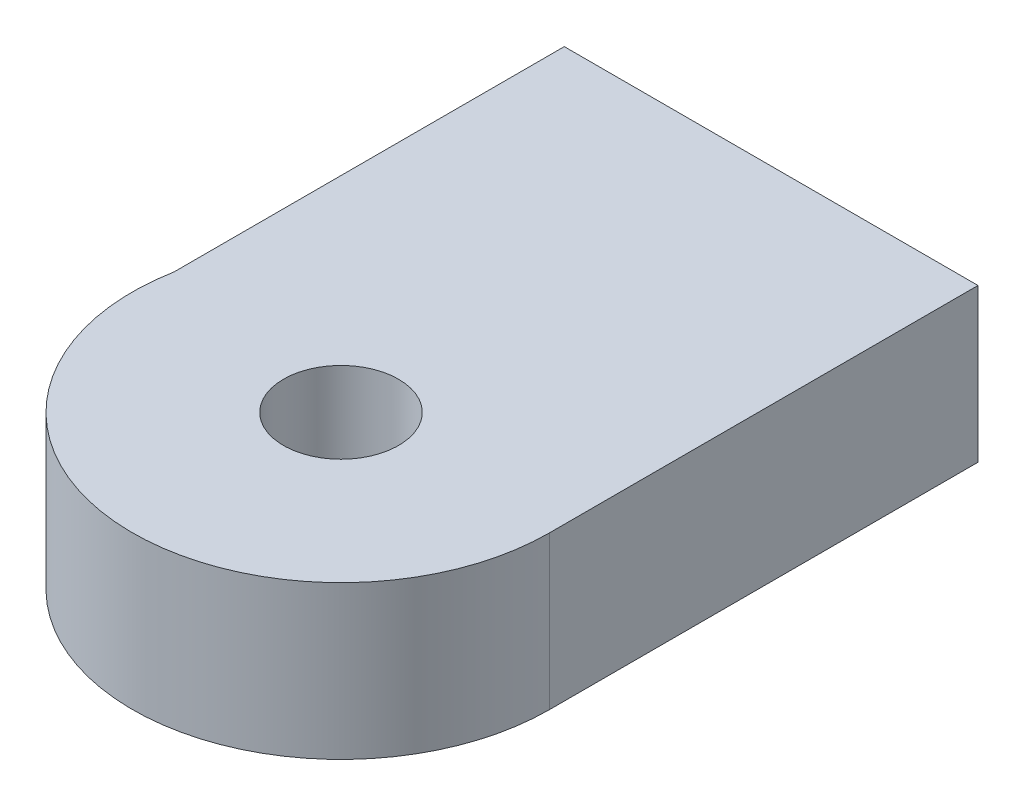
ISO-10303-21;
HEADER;
FILE_DESCRIPTION(('STEP AP214'),'2;1');
FILE_NAME('part.step','',(''),(''),'','','');
FILE_SCHEMA(('AUTOMOTIVE_DESIGN { 1 0 10303 214 1 1 1 1 }'));
ENDSEC;
DATA;
#1=APPLICATION_CONTEXT('core data for automotive mechanical design processes');
#2=APPLICATION_PROTOCOL_DEFINITION('international standard','automotive_design',2000,#1);
#3=PRODUCT_CONTEXT('',#1,'mechanical');
#4=PRODUCT('Part','Part','',(#3));
#5=PRODUCT_RELATED_PRODUCT_CATEGORY('part','',(#4));
#6=PRODUCT_DEFINITION_FORMATION('','',#4);
#7=PRODUCT_DEFINITION_CONTEXT('part definition',#1,'design');
#8=PRODUCT_DEFINITION('design','',#6,#7);
#9=PRODUCT_DEFINITION_SHAPE('','',#8);
#10=(LENGTH_UNIT() NAMED_UNIT(*) SI_UNIT(.MILLI.,.METRE.));
#11=(NAMED_UNIT(*) PLANE_ANGLE_UNIT() SI_UNIT($,.RADIAN.));
#12=(NAMED_UNIT(*) SI_UNIT($,.STERADIAN.) SOLID_ANGLE_UNIT());
#13=UNCERTAINTY_MEASURE_WITH_UNIT(LENGTH_MEASURE(1.E-05),#10,'distance_accuracy_value','');
#14=(GEOMETRIC_REPRESENTATION_CONTEXT(3) GLOBAL_UNCERTAINTY_ASSIGNED_CONTEXT((#13)) GLOBAL_UNIT_ASSIGNED_CONTEXT((#10,
#11,#12)) REPRESENTATION_CONTEXT('',''));
#15=CARTESIAN_POINT('',(0.,0.,0.));
#16=DIRECTION('',(0.,0.,1.));
#17=DIRECTION('',(1.,0.,0.));
#18=AXIS2_PLACEMENT_3D('',#15,#16,#17);
#19=CARTESIAN_POINT('',(-53.6939675410073,-2070.74992623645,-163.840329353942));
#20=DIRECTION('',(0.,-1.,0.));
#21=DIRECTION('',(1.,0.,0.));
#22=AXIS2_PLACEMENT_3D('',#19,#20,#21);
#23=CYLINDRICAL_SURFACE('',#22,12.7);
#24=DIRECTION('',(0.,-1.,0.));
#25=VECTOR('',#24,1.);
#26=CARTESIAN_POINT('',(-40.9939675410073,-2101.38992623645,-163.840329353942));
#27=LINE('',#26,#25);
#28=CARTESIAN_POINT('',(-40.9939675410073,-2102.06910154193,-163.840329353942));
#29=VERTEX_POINT('',#28);
#30=CARTESIAN_POINT('',(-40.9939675410073,-2111.38992623645,-163.840329353942));
#31=VERTEX_POINT('',#30);
#32=EDGE_CURVE('E64',#29,#31,#27,.T.);
#33=ORIENTED_EDGE('',*,*,#32,.F.);
#34=CARTESIAN_POINT('',(-53.6939675410073,-2102.06910154193,-163.840329353942));
#35=DIRECTION('',(0.,-1.,0.));
#36=DIRECTION('',(0.,0.,-1.));
#37=AXIS2_PLACEMENT_3D('',#34,#35,#36);
#38=CIRCLE('',#37,12.7);
#39=CARTESIAN_POINT('',(-66.179661452878,-2102.06910154193,-166.163570094605));
#40=VERTEX_POINT('',#39);
#41=EDGE_CURVE('E106',#29,#40,#38,.T.);
#42=ORIENTED_EDGE('',*,*,#41,.T.);
#43=DIRECTION('',(0.,-1.,0.));
#44=VECTOR('',#43,1.);
#45=CARTESIAN_POINT('',(-66.179661452878,-2101.38992623645,-166.163570094605));
#46=LINE('',#45,#44);
#47=CARTESIAN_POINT('',(-66.179661452878,-2111.38992623645,-166.163570094605));
#48=VERTEX_POINT('',#47);
#49=EDGE_CURVE('E105',#40,#48,#46,.T.);
#50=ORIENTED_EDGE('',*,*,#49,.T.);
#51=CARTESIAN_POINT('',(-53.6939675410073,-2111.38992623645,-163.840329353942));
#52=DIRECTION('',(0.,1.,0.));
#53=DIRECTION('',(-1.,0.,0.));
#54=AXIS2_PLACEMENT_3D('',#51,#52,#53);
#55=CIRCLE('',#54,12.7);
#56=EDGE_CURVE('E11',#48,#31,#55,.T.);
#57=ORIENTED_EDGE('',*,*,#56,.T.);
#58=EDGE_LOOP('',(#33,#42,#50,#57));
#59=FACE_BOUND('',#58,.T.);
#60=ADVANCED_FACE('F43',(#59),#23,.T.);
#61=CARTESIAN_POINT('',(-53.6939675410073,-2111.38992623645,-163.840329353942));
#62=DIRECTION('',(0.,1.,0.));
#63=DIRECTION('',(-1.,0.,0.));
#64=AXIS2_PLACEMENT_3D('',#61,#62,#63);
#65=PLANE('',#64);
#66=CARTESIAN_POINT('',(-61.9428595120541,-2111.38992623645,-159.077829353942));
#67=DIRECTION('',(0.,-1.,0.));
#68=DIRECTION('',(0.,0.,-1.));
#69=AXIS2_PLACEMENT_3D('',#66,#67,#68);
#70=CIRCLE('',#69,1.77799999999999);
#71=CARTESIAN_POINT('',(-61.9428595120541,-2111.38992623645,-160.855829353942));
#72=VERTEX_POINT('',#71);
#73=EDGE_CURVE('E133',#72,#72,#70,.T.);
#74=ORIENTED_EDGE('',*,*,#73,.F.);
#75=EDGE_LOOP('',(#74));
#76=FACE_BOUND('',#75,.T.);
#77=CARTESIAN_POINT('',(-53.6939675410073,-2111.38992623645,-173.365329353942));
#78=DIRECTION('',(0.,-1.,0.));
#79=DIRECTION('',(0.,0.,-1.));
#80=AXIS2_PLACEMENT_3D('',#77,#78,#79);
#81=CIRCLE('',#80,1.778);
#82=CARTESIAN_POINT('',(-53.6939675410073,-2111.38992623645,-175.143329353942));
#83=VERTEX_POINT('',#82);
#84=EDGE_CURVE('E139',#83,#83,#81,.T.);
#85=ORIENTED_EDGE('',*,*,#84,.F.);
#86=EDGE_LOOP('',(#85));
#87=FACE_BOUND('',#86,.T.);
#88=CARTESIAN_POINT('',(-45.4450755699605,-2111.38992623645,-159.077829353942));
#89=DIRECTION('',(0.,-1.,0.));
#90=DIRECTION('',(0.,0.,-1.));
#91=AXIS2_PLACEMENT_3D('',#88,#89,#90);
#92=CIRCLE('',#91,1.77799999999999);
#93=CARTESIAN_POINT('',(-45.4450755699605,-2111.38992623645,-160.855829353942));
#94=VERTEX_POINT('',#93);
#95=EDGE_CURVE('E128',#94,#94,#92,.T.);
#96=ORIENTED_EDGE('',*,*,#95,.F.);
#97=EDGE_LOOP('',(#96));
#98=FACE_BOUND('',#97,.T.);
#99=CARTESIAN_POINT('',(-53.6939675410073,-2111.38992623645,-163.840329353942));
#100=DIRECTION('',(0.,1.,0.));
#101=DIRECTION('',(-1.,0.,0.));
#102=AXIS2_PLACEMENT_3D('',#99,#100,#101);
#103=CIRCLE('',#102,3.5);
#104=CARTESIAN_POINT('',(-57.1939675410073,-2111.38992623645,-163.840329353942));
#105=VERTEX_POINT('',#104);
#106=EDGE_CURVE('E50',#105,#105,#103,.F.);
#107=ORIENTED_EDGE('',*,*,#106,.F.);
#108=EDGE_LOOP('',(#107));
#109=FACE_BOUND('',#108,.T.);
#110=ORIENTED_EDGE('',*,*,#56,.F.);
#111=DIRECTION('',(0.,0.,-1.));
#112=VECTOR('',#111,1.);
#113=CARTESIAN_POINT('',(-66.179661452878,-2111.38992623645,-166.163570094605));
#114=LINE('',#113,#112);
#115=CARTESIAN_POINT('',(-66.179661452878,-2111.38992623645,-189.919076926775));
#116=VERTEX_POINT('',#115);
#117=EDGE_CURVE('E122',#48,#116,#114,.T.);
#118=ORIENTED_EDGE('',*,*,#117,.T.);
#119=DIRECTION('',(1.,0.,0.));
#120=VECTOR('',#119,1.);
#121=CARTESIAN_POINT('',(-40.9939675410073,-2111.38992623645,-189.919076926775));
#122=LINE('',#121,#120);
#123=CARTESIAN_POINT('',(-40.9939675410073,-2111.38992623645,-189.919076926775));
#124=VERTEX_POINT('',#123);
#125=EDGE_CURVE('E111',#116,#124,#122,.T.);
#126=ORIENTED_EDGE('',*,*,#125,.T.);
#127=DIRECTION('',(0.,0.,1.));
#128=VECTOR('',#127,1.);
#129=CARTESIAN_POINT('',(-40.9939675410073,-2111.38992623645,-163.840329353942));
#130=LINE('',#129,#128);
#131=EDGE_CURVE('E124',#124,#31,#130,.T.);
#132=ORIENTED_EDGE('',*,*,#131,.T.);
#133=EDGE_LOOP('',(#110,#118,#126,#132));
#134=FACE_BOUND('',#133,.T.);
#135=ADVANCED_FACE('F151',(#76,#87,#98,#109,#134),#65,.F.);
#136=CARTESIAN_POINT('',(-53.6939675410073,-2121.28942117306,-163.840329353942));
#137=DIRECTION('',(0.,1.,0.));
#138=DIRECTION('',(0.,0.,1.));
#139=AXIS2_PLACEMENT_3D('',#136,#137,#138);
#140=CYLINDRICAL_SURFACE('',#139,3.5);
#141=CARTESIAN_POINT('',(-53.6939675410073,-2102.06910154193,-163.840329353942));
#142=DIRECTION('',(0.,-1.,0.));
#143=DIRECTION('',(0.,0.,-1.));
#144=AXIS2_PLACEMENT_3D('',#141,#142,#143);
#145=CIRCLE('',#144,3.5);
#146=CARTESIAN_POINT('',(-53.6939675410073,-2102.06910154193,-167.340329353942));
#147=VERTEX_POINT('',#146);
#148=EDGE_CURVE('E157',#147,#147,#145,.F.);
#149=ORIENTED_EDGE('',*,*,#148,.T.);
#150=EDGE_LOOP('',(#149));
#151=FACE_BOUND('',#150,.T.);
#152=ORIENTED_EDGE('',*,*,#106,.T.);
#153=EDGE_LOOP('',(#152));
#154=FACE_BOUND('',#153,.T.);
#155=ADVANCED_FACE('F149',(#151,#154),#140,.F.);
#156=CARTESIAN_POINT('',(-45.4450755699605,-2105.38992623645,-159.077829353942));
#157=DIRECTION('',(0.,-1.,0.));
#158=DIRECTION('',(0.,0.,-1.));
#159=AXIS2_PLACEMENT_3D('',#156,#157,#158);
#160=CYLINDRICAL_SURFACE('',#159,1.77799999999999);
#161=CARTESIAN_POINT('',(-45.4450755699605,-2105.38992623645,-159.077829353942));
#162=DIRECTION('',(0.,-1.,0.));
#163=DIRECTION('',(0.,0.,-1.));
#164=AXIS2_PLACEMENT_3D('',#161,#162,#163);
#165=CIRCLE('',#164,1.77799999999999);
#166=CARTESIAN_POINT('',(-45.4450755699605,-2105.38992623645,-160.855829353942));
#167=VERTEX_POINT('',#166);
#168=EDGE_CURVE('E142',#167,#167,#165,.T.);
#169=ORIENTED_EDGE('',*,*,#168,.F.);
#170=EDGE_LOOP('',(#169));
#171=FACE_BOUND('',#170,.T.);
#172=ORIENTED_EDGE('',*,*,#95,.T.);
#173=EDGE_LOOP('',(#172));
#174=FACE_BOUND('',#173,.T.);
#175=ADVANCED_FACE('F227',(#171,#174),#160,.F.);
#176=CARTESIAN_POINT('',(-45.4450755699605,-2105.38992623645,-159.077829353942));
#177=DIRECTION('',(0.,-1.,0.));
#178=DIRECTION('',(0.,0.,-1.));
#179=AXIS2_PLACEMENT_3D('',#176,#177,#178);
#180=PLANE('',#179);
#181=ORIENTED_EDGE('',*,*,#168,.T.);
#182=EDGE_LOOP('',(#181));
#183=FACE_BOUND('',#182,.T.);
#184=ADVANCED_FACE('F379',(#183),#180,.T.);
#185=CARTESIAN_POINT('',(-53.6939675410073,-2105.38992623645,-173.365329353942));
#186=DIRECTION('',(0.,-1.,0.));
#187=DIRECTION('',(0.,0.,-1.));
#188=AXIS2_PLACEMENT_3D('',#185,#186,#187);
#189=CYLINDRICAL_SURFACE('',#188,1.778);
#190=CARTESIAN_POINT('',(-53.6939675410073,-2105.38992623645,-173.365329353942));
#191=DIRECTION('',(0.,-1.,0.));
#192=DIRECTION('',(0.,0.,-1.));
#193=AXIS2_PLACEMENT_3D('',#190,#191,#192);
#194=CIRCLE('',#193,1.778);
#195=CARTESIAN_POINT('',(-53.6939675410073,-2105.38992623645,-175.143329353942));
#196=VERTEX_POINT('',#195);
#197=EDGE_CURVE('E136',#196,#196,#194,.T.);
#198=ORIENTED_EDGE('',*,*,#197,.F.);
#199=EDGE_LOOP('',(#198));
#200=FACE_BOUND('',#199,.T.);
#201=ORIENTED_EDGE('',*,*,#84,.T.);
#202=EDGE_LOOP('',(#201));
#203=FACE_BOUND('',#202,.T.);
#204=ADVANCED_FACE('F371',(#200,#203),#189,.F.);
#205=CARTESIAN_POINT('',(-53.6939675410073,-2105.38992623645,-173.365329353942));
#206=DIRECTION('',(0.,-1.,0.));
#207=DIRECTION('',(0.,0.,-1.));
#208=AXIS2_PLACEMENT_3D('',#205,#206,#207);
#209=PLANE('',#208);
#210=ORIENTED_EDGE('',*,*,#197,.T.);
#211=EDGE_LOOP('',(#210));
#212=FACE_BOUND('',#211,.T.);
#213=ADVANCED_FACE('F363',(#212),#209,.T.);
#214=CARTESIAN_POINT('',(-61.9428595120541,-2105.38992623645,-159.077829353942));
#215=DIRECTION('',(0.,-1.,0.));
#216=DIRECTION('',(0.,0.,-1.));
#217=AXIS2_PLACEMENT_3D('',#214,#215,#216);
#218=CYLINDRICAL_SURFACE('',#217,1.77799999999999);
#219=CARTESIAN_POINT('',(-61.9428595120541,-2105.38992623645,-159.077829353942));
#220=DIRECTION('',(0.,-1.,0.));
#221=DIRECTION('',(0.,0.,-1.));
#222=AXIS2_PLACEMENT_3D('',#219,#220,#221);
#223=CIRCLE('',#222,1.77799999999999);
#224=CARTESIAN_POINT('',(-61.9428595120541,-2105.38992623645,-160.855829353942));
#225=VERTEX_POINT('',#224);
#226=EDGE_CURVE('E130',#225,#225,#223,.T.);
#227=ORIENTED_EDGE('',*,*,#226,.F.);
#228=EDGE_LOOP('',(#227));
#229=FACE_BOUND('',#228,.T.);
#230=ORIENTED_EDGE('',*,*,#73,.T.);
#231=EDGE_LOOP('',(#230));
#232=FACE_BOUND('',#231,.T.);
#233=ADVANCED_FACE('F355',(#229,#232),#218,.F.);
#234=CARTESIAN_POINT('',(-61.9428595120541,-2105.38992623645,-159.077829353942));
#235=DIRECTION('',(0.,-1.,0.));
#236=DIRECTION('',(0.,0.,-1.));
#237=AXIS2_PLACEMENT_3D('',#234,#235,#236);
#238=PLANE('',#237);
#239=ORIENTED_EDGE('',*,*,#226,.T.);
#240=EDGE_LOOP('',(#239));
#241=FACE_BOUND('',#240,.T.);
#242=ADVANCED_FACE('F236',(#241),#238,.T.);
#243=CARTESIAN_POINT('',(-40.9939675410073,-2101.38992623645,-163.840329353942));
#244=DIRECTION('',(1.,0.,0.));
#245=DIRECTION('',(0.,1.,0.));
#246=AXIS2_PLACEMENT_3D('',#243,#244,#245);
#247=PLANE('',#246);
#248=DIRECTION('',(0.,0.,-1.));
#249=VECTOR('',#248,1.);
#250=CARTESIAN_POINT('',(-40.9939675410072,-2102.06910154193,-151.140329353942));
#251=LINE('',#250,#249);
#252=CARTESIAN_POINT('',(-40.9939675410073,-2102.06910154193,-189.919076926775));
#253=VERTEX_POINT('',#252);
#254=EDGE_CURVE('E57',#29,#253,#251,.T.);
#255=ORIENTED_EDGE('',*,*,#254,.F.);
#256=ORIENTED_EDGE('',*,*,#32,.T.);
#257=ORIENTED_EDGE('',*,*,#131,.F.);
#258=DIRECTION('',(0.,1.,0.));
#259=VECTOR('',#258,1.);
#260=CARTESIAN_POINT('',(-40.9939675410073,-2101.38992623645,-189.919076926775));
#261=LINE('',#260,#259);
#262=EDGE_CURVE('E114',#124,#253,#261,.T.);
#263=ORIENTED_EDGE('',*,*,#262,.T.);
#264=EDGE_LOOP('',(#255,#256,#257,#263));
#265=FACE_BOUND('',#264,.T.);
#266=ADVANCED_FACE('F206',(#265),#247,.T.);
#267=CARTESIAN_POINT('',(-66.179661452878,-2101.38992623645,-166.163570094605));
#268=DIRECTION('',(-1.,0.,0.));
#269=DIRECTION('',(0.,-1.,0.));
#270=AXIS2_PLACEMENT_3D('',#267,#268,#269);
#271=PLANE('',#270);
#272=DIRECTION('',(0.,0.,1.));
#273=VECTOR('',#272,1.);
#274=CARTESIAN_POINT('',(-66.179661452878,-2102.06910154193,-166.163570094605));
#275=LINE('',#274,#273);
#276=CARTESIAN_POINT('',(-66.179661452878,-2102.06910154193,-189.919076926775));
#277=VERTEX_POINT('',#276);
#278=EDGE_CURVE('E93',#277,#40,#275,.T.);
#279=ORIENTED_EDGE('',*,*,#278,.F.);
#280=DIRECTION('',(0.,-1.,0.));
#281=VECTOR('',#280,1.);
#282=CARTESIAN_POINT('',(-66.179661452878,-2101.38992623645,-189.919076926775));
#283=LINE('',#282,#281);
#284=EDGE_CURVE('E103',#277,#116,#283,.T.);
#285=ORIENTED_EDGE('',*,*,#284,.T.);
#286=ORIENTED_EDGE('',*,*,#117,.F.);
#287=ORIENTED_EDGE('',*,*,#49,.F.);
#288=EDGE_LOOP('',(#279,#285,#286,#287));
#289=FACE_BOUND('',#288,.T.);
#290=ADVANCED_FACE('F101',(#289),#271,.T.);
#291=CARTESIAN_POINT('',(399.459604492078,-1664.88134965421,-189.919076926775));
#292=DIRECTION('',(0.,0.,1.));
#293=DIRECTION('',(-0.9999980793749,-0.00195990982184696,0.));
#294=AXIS2_PLACEMENT_3D('',#291,#292,#293);
#295=PLANE('',#294);
#296=CARTESIAN_POINT('',(-53.586814498129,-2106.38992623204,-189.919076926774));
#297=DIRECTION('',(0.,0.,-1.));
#298=DIRECTION('',(0.,1.,0.));
#299=AXIS2_PLACEMENT_3D('',#296,#297,#298);
#300=CIRCLE('',#299,3.15);
#301=CARTESIAN_POINT('',(-53.586814498129,-2103.23992623204,-189.919076926774));
#302=VERTEX_POINT('',#301);
#303=EDGE_CURVE('E160',#302,#302,#300,.T.);
#304=ORIENTED_EDGE('',*,*,#303,.F.);
#305=EDGE_LOOP('',(#304));
#306=FACE_BOUND('',#305,.T.);
#307=CARTESIAN_POINT('',(-62.6263575121822,-2106.38992623204,-189.919076926774));
#308=DIRECTION('',(0.,0.,-1.));
#309=DIRECTION('',(0.,1.,0.));
#310=AXIS2_PLACEMENT_3D('',#307,#308,#309);
#311=CIRCLE('',#310,3.15);
#312=CARTESIAN_POINT('',(-62.6263575121822,-2103.23992623204,-189.919076926774));
#313=VERTEX_POINT('',#312);
#314=EDGE_CURVE('E172',#313,#313,#311,.T.);
#315=ORIENTED_EDGE('',*,*,#314,.F.);
#316=EDGE_LOOP('',(#315));
#317=FACE_BOUND('',#316,.T.);
#318=CARTESIAN_POINT('',(-44.5472714840758,-2106.38992623204,-189.919076926774));
#319=DIRECTION('',(0.,0.,-1.));
#320=DIRECTION('',(0.,1.,0.));
#321=AXIS2_PLACEMENT_3D('',#318,#319,#320);
#322=CIRCLE('',#321,3.15);
#323=CARTESIAN_POINT('',(-44.5472714840758,-2103.23992623204,-189.919076926774));
#324=VERTEX_POINT('',#323);
#325=EDGE_CURVE('E181',#324,#324,#322,.T.);
#326=ORIENTED_EDGE('',*,*,#325,.F.);
#327=EDGE_LOOP('',(#326));
#328=FACE_BOUND('',#327,.T.);
#329=ORIENTED_EDGE('',*,*,#284,.F.);
#330=DIRECTION('',(-1.,0.,0.));
#331=VECTOR('',#330,1.);
#332=CARTESIAN_POINT('',(-40.9939675410073,-2102.06910154193,-189.919076926775));
#333=LINE('',#332,#331);
#334=EDGE_CURVE('E89',#253,#277,#333,.T.);
#335=ORIENTED_EDGE('',*,*,#334,.F.);
#336=ORIENTED_EDGE('',*,*,#262,.F.);
#337=ORIENTED_EDGE('',*,*,#125,.F.);
#338=EDGE_LOOP('',(#329,#335,#336,#337));
#339=FACE_BOUND('',#338,.T.);
#340=ADVANCED_FACE('F109',(#306,#317,#328,#339),#295,.F.);
#341=CARTESIAN_POINT('',(-44.5472714840758,-2106.38992623204,-180.940539979121));
#342=DIRECTION('',(0.,0.,-1.));
#343=DIRECTION('',(0.,1.,0.));
#344=AXIS2_PLACEMENT_3D('',#341,#342,#343);
#345=CONICAL_SURFACE('',#344,1.7,1.02974425867666);
#346=CARTESIAN_POINT('',(-44.5472714840758,-2106.38992623204,-179.919076926774));
#347=VERTEX_POINT('',#346);
#348=VERTEX_LOOP('',#347);
#349=FACE_BOUND('',#348,.T.);
#350=CARTESIAN_POINT('',(-44.5472714840758,-2106.38992623204,-180.940539979121));
#351=DIRECTION('',(0.,0.,-1.));
#352=DIRECTION('',(0.,1.,0.));
#353=AXIS2_PLACEMENT_3D('',#350,#351,#352);
#354=CIRCLE('',#353,1.7);
#355=CARTESIAN_POINT('',(-44.5472714840758,-2104.68992623204,-180.940539979121));
#356=VERTEX_POINT('',#355);
#357=EDGE_CURVE('E112',#356,#356,#354,.T.);
#358=ORIENTED_EDGE('',*,*,#357,.T.);
#359=EDGE_LOOP('',(#358));
#360=FACE_BOUND('',#359,.T.);
#361=ADVANCED_FACE('F196',(#349,#360),#345,.F.);
#362=CARTESIAN_POINT('',(-44.5472714840758,-2106.38992623204,-189.919076926774));
#363=DIRECTION('',(0.,0.,-1.));
#364=DIRECTION('',(0.,1.,0.));
#365=AXIS2_PLACEMENT_3D('',#362,#363,#364);
#366=CYLINDRICAL_SURFACE('',#365,1.7);
#367=ORIENTED_EDGE('',*,*,#357,.F.);
#368=EDGE_LOOP('',(#367));
#369=FACE_BOUND('',#368,.T.);
#370=CARTESIAN_POINT('',(-44.5472714840758,-2106.38992623204,-188.469076926774));
#371=DIRECTION('',(0.,0.,-1.));
#372=DIRECTION('',(0.,1.,0.));
#373=AXIS2_PLACEMENT_3D('',#370,#371,#372);
#374=CIRCLE('',#373,1.69999999999999);
#375=CARTESIAN_POINT('',(-44.5472714840758,-2104.68992623204,-188.469076926774));
#376=VERTEX_POINT('',#375);
#377=EDGE_CURVE('E117',#376,#376,#374,.T.);
#378=ORIENTED_EDGE('',*,*,#377,.T.);
#379=EDGE_LOOP('',(#378));
#380=FACE_BOUND('',#379,.T.);
#381=ADVANCED_FACE('F186',(#369,#380),#366,.F.);
#382=CARTESIAN_POINT('',(-44.5472714840758,-2106.38992623204,-189.919076926774));
#383=DIRECTION('',(0.,0.,-1.));
#384=DIRECTION('',(0.,1.,0.));
#385=AXIS2_PLACEMENT_3D('',#382,#383,#384);
#386=CONICAL_SURFACE('',#385,3.15,0.785398163397448);
#387=ORIENTED_EDGE('',*,*,#377,.F.);
#388=EDGE_LOOP('',(#387));
#389=FACE_BOUND('',#388,.T.);
#390=ORIENTED_EDGE('',*,*,#325,.T.);
#391=EDGE_LOOP('',(#390));
#392=FACE_BOUND('',#391,.T.);
#393=ADVANCED_FACE('F188',(#389,#392),#386,.F.);
#394=CARTESIAN_POINT('',(-62.6263575121822,-2106.38992623204,-180.940539979121));
#395=DIRECTION('',(0.,0.,-1.));
#396=DIRECTION('',(0.,1.,0.));
#397=AXIS2_PLACEMENT_3D('',#394,#395,#396);
#398=CONICAL_SURFACE('',#397,1.7,1.02974425867666);
#399=CARTESIAN_POINT('',(-62.6263575121822,-2106.38992623204,-179.919076926774));
#400=VERTEX_POINT('',#399);
#401=VERTEX_LOOP('',#400);
#402=FACE_BOUND('',#401,.T.);
#403=CARTESIAN_POINT('',(-62.6263575121822,-2106.38992623204,-180.940539979121));
#404=DIRECTION('',(0.,0.,-1.));
#405=DIRECTION('',(0.,1.,0.));
#406=AXIS2_PLACEMENT_3D('',#403,#404,#405);
#407=CIRCLE('',#406,1.7);
#408=CARTESIAN_POINT('',(-62.6263575121822,-2104.68992623204,-180.940539979121));
#409=VERTEX_POINT('',#408);
#410=EDGE_CURVE('E178',#409,#409,#407,.T.);
#411=ORIENTED_EDGE('',*,*,#410,.T.);
#412=EDGE_LOOP('',(#411));
#413=FACE_BOUND('',#412,.T.);
#414=ADVANCED_FACE('F191',(#402,#413),#398,.F.);
#415=CARTESIAN_POINT('',(-62.6263575121822,-2106.38992623204,-189.919076926774));
#416=DIRECTION('',(0.,0.,-1.));
#417=DIRECTION('',(0.,1.,0.));
#418=AXIS2_PLACEMENT_3D('',#415,#416,#417);
#419=CYLINDRICAL_SURFACE('',#418,1.7);
#420=ORIENTED_EDGE('',*,*,#410,.F.);
#421=EDGE_LOOP('',(#420));
#422=FACE_BOUND('',#421,.T.);
#423=CARTESIAN_POINT('',(-62.6263575121822,-2106.38992623204,-188.469076926774));
#424=DIRECTION('',(0.,0.,-1.));
#425=DIRECTION('',(0.,1.,0.));
#426=AXIS2_PLACEMENT_3D('',#423,#424,#425);
#427=CIRCLE('',#426,1.69999999999999);
#428=CARTESIAN_POINT('',(-62.6263575121822,-2104.68992623204,-188.469076926774));
#429=VERTEX_POINT('',#428);
#430=EDGE_CURVE('E175',#429,#429,#427,.T.);
#431=ORIENTED_EDGE('',*,*,#430,.T.);
#432=EDGE_LOOP('',(#431));
#433=FACE_BOUND('',#432,.T.);
#434=ADVANCED_FACE('F280',(#422,#433),#419,.F.);
#435=CARTESIAN_POINT('',(-62.6263575121822,-2106.38992623204,-189.919076926774));
#436=DIRECTION('',(0.,0.,-1.));
#437=DIRECTION('',(0.,1.,0.));
#438=AXIS2_PLACEMENT_3D('',#435,#436,#437);
#439=CONICAL_SURFACE('',#438,3.15,0.785398163397448);
#440=ORIENTED_EDGE('',*,*,#430,.F.);
#441=EDGE_LOOP('',(#440));
#442=FACE_BOUND('',#441,.T.);
#443=ORIENTED_EDGE('',*,*,#314,.T.);
#444=EDGE_LOOP('',(#443));
#445=FACE_BOUND('',#444,.T.);
#446=ADVANCED_FACE('F290',(#442,#445),#439,.F.);
#447=CARTESIAN_POINT('',(-53.586814498129,-2106.38992623204,-180.940539979121));
#448=DIRECTION('',(0.,0.,-1.));
#449=DIRECTION('',(0.,1.,0.));
#450=AXIS2_PLACEMENT_3D('',#447,#448,#449);
#451=CONICAL_SURFACE('',#450,1.7,1.02974425867666);
#452=CARTESIAN_POINT('',(-53.586814498129,-2106.38992623204,-179.919076926774));
#453=VERTEX_POINT('',#452);
#454=VERTEX_LOOP('',#453);
#455=FACE_BOUND('',#454,.T.);
#456=CARTESIAN_POINT('',(-53.586814498129,-2106.38992623204,-180.940539979121));
#457=DIRECTION('',(0.,0.,-1.));
#458=DIRECTION('',(0.,1.,0.));
#459=AXIS2_PLACEMENT_3D('',#456,#457,#458);
#460=CIRCLE('',#459,1.7);
#461=CARTESIAN_POINT('',(-53.586814498129,-2104.68992623204,-180.940539979121));
#462=VERTEX_POINT('',#461);
#463=EDGE_CURVE('E169',#462,#462,#460,.T.);
#464=ORIENTED_EDGE('',*,*,#463,.T.);
#465=EDGE_LOOP('',(#464));
#466=FACE_BOUND('',#465,.T.);
#467=ADVANCED_FACE('F300',(#455,#466),#451,.F.);
#468=CARTESIAN_POINT('',(-53.586814498129,-2106.38992623204,-189.919076926774));
#469=DIRECTION('',(0.,0.,-1.));
#470=DIRECTION('',(0.,1.,0.));
#471=AXIS2_PLACEMENT_3D('',#468,#469,#470);
#472=CYLINDRICAL_SURFACE('',#471,1.7);
#473=ORIENTED_EDGE('',*,*,#463,.F.);
#474=EDGE_LOOP('',(#473));
#475=FACE_BOUND('',#474,.T.);
#476=CARTESIAN_POINT('',(-53.586814498129,-2106.38992623204,-188.469076926774));
#477=DIRECTION('',(0.,0.,-1.));
#478=DIRECTION('',(0.,1.,0.));
#479=AXIS2_PLACEMENT_3D('',#476,#477,#478);
#480=CIRCLE('',#479,1.69999999999999);
#481=CARTESIAN_POINT('',(-53.586814498129,-2104.68992623204,-188.469076926774));
#482=VERTEX_POINT('',#481);
#483=EDGE_CURVE('E166',#482,#482,#480,.T.);
#484=ORIENTED_EDGE('',*,*,#483,.T.);
#485=EDGE_LOOP('',(#484));
#486=FACE_BOUND('',#485,.T.);
#487=ADVANCED_FACE('F310',(#475,#486),#472,.F.);
#488=CARTESIAN_POINT('',(-53.586814498129,-2106.38992623204,-189.919076926774));
#489=DIRECTION('',(0.,0.,-1.));
#490=DIRECTION('',(0.,1.,0.));
#491=AXIS2_PLACEMENT_3D('',#488,#489,#490);
#492=CONICAL_SURFACE('',#491,3.15,0.785398163397448);
#493=ORIENTED_EDGE('',*,*,#483,.F.);
#494=EDGE_LOOP('',(#493));
#495=FACE_BOUND('',#494,.T.);
#496=ORIENTED_EDGE('',*,*,#303,.T.);
#497=EDGE_LOOP('',(#496));
#498=FACE_BOUND('',#497,.T.);
#499=ADVANCED_FACE('F220',(#495,#498),#492,.F.);
#500=CARTESIAN_POINT('',(-40.9939675410072,-2102.06910154193,-151.140329353942));
#501=DIRECTION('',(0.,-1.,0.));
#502=DIRECTION('',(0.,0.,-1.));
#503=AXIS2_PLACEMENT_3D('',#500,#501,#502);
#504=PLANE('',#503);
#505=ORIENTED_EDGE('',*,*,#254,.T.);
#506=ORIENTED_EDGE('',*,*,#334,.T.);
#507=ORIENTED_EDGE('',*,*,#278,.T.);
#508=ORIENTED_EDGE('',*,*,#41,.F.);
#509=EDGE_LOOP('',(#505,#506,#507,#508));
#510=FACE_BOUND('',#509,.T.);
#511=ORIENTED_EDGE('',*,*,#148,.F.);
#512=EDGE_LOOP('',(#511));
#513=FACE_BOUND('',#512,.T.);
#514=ADVANCED_FACE('F91',(#510,#513),#504,.F.);
#515=CLOSED_SHELL('',(#60,#135,#155,#175,#184,#204,#213,#233,#242,#266,#290,#340,#361,#381,#393,
#414,#434,#446,#467,#487,#499,#514));
#516=MANIFOLD_SOLID_BREP('B2',#515);
#517=ADVANCED_BREP_SHAPE_REPRESENTATION('',(#18,#516),#14);
#518=SHAPE_DEFINITION_REPRESENTATION(#9,#517);
ENDSEC;
END-ISO-10303-21;
